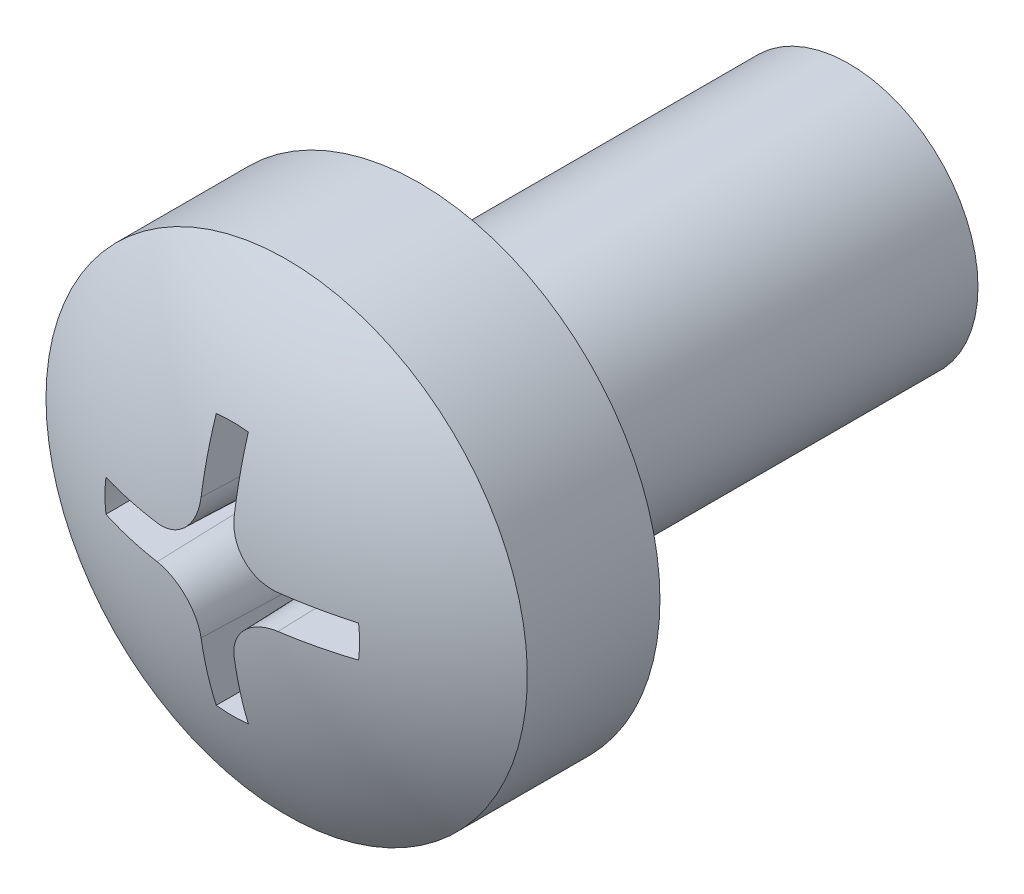
ISO-10303-21;
HEADER;
FILE_DESCRIPTION(('STEP AP214'),'2;1');
FILE_NAME('part.step','',(''),(''),'','','');
FILE_SCHEMA(('AUTOMOTIVE_DESIGN { 1 0 10303 214 1 1 1 1 }'));
ENDSEC;
DATA;
#1=APPLICATION_CONTEXT('core data for automotive mechanical design processes');
#2=APPLICATION_PROTOCOL_DEFINITION('international standard','automotive_design',2000,#1);
#3=PRODUCT_CONTEXT('',#1,'mechanical');
#4=PRODUCT('Part','Part','',(#3));
#5=PRODUCT_RELATED_PRODUCT_CATEGORY('part','',(#4));
#6=PRODUCT_DEFINITION_FORMATION('','',#4);
#7=PRODUCT_DEFINITION_CONTEXT('part definition',#1,'design');
#8=PRODUCT_DEFINITION('design','',#6,#7);
#9=PRODUCT_DEFINITION_SHAPE('','',#8);
#10=(LENGTH_UNIT() NAMED_UNIT(*) SI_UNIT(.MILLI.,.METRE.));
#11=(NAMED_UNIT(*) PLANE_ANGLE_UNIT() SI_UNIT($,.RADIAN.));
#12=(NAMED_UNIT(*) SI_UNIT($,.STERADIAN.) SOLID_ANGLE_UNIT());
#13=UNCERTAINTY_MEASURE_WITH_UNIT(LENGTH_MEASURE(1.E-05),#10,'distance_accuracy_value','');
#14=(GEOMETRIC_REPRESENTATION_CONTEXT(3) GLOBAL_UNCERTAINTY_ASSIGNED_CONTEXT((#13)) GLOBAL_UNIT_ASSIGNED_CONTEXT((#10,
#11,#12)) REPRESENTATION_CONTEXT('',''));
#15=CARTESIAN_POINT('',(0.,0.,0.));
#16=DIRECTION('',(0.,0.,1.));
#17=DIRECTION('',(1.,0.,0.));
#18=AXIS2_PLACEMENT_3D('',#15,#16,#17);
#19=CARTESIAN_POINT('',(0.,0.,5.));
#20=DIRECTION('',(0.,0.,-1.));
#21=DIRECTION('',(-1.,0.,0.));
#22=AXIS2_PLACEMENT_3D('',#19,#20,#21);
#23=CYLINDRICAL_SURFACE('',#22,1.5);
#24=CARTESIAN_POINT('',(0.,0.,5.));
#25=DIRECTION('',(0.,0.,1.));
#26=DIRECTION('',(1.,0.,0.));
#27=AXIS2_PLACEMENT_3D('',#24,#25,#26);
#28=CIRCLE('',#27,1.5);
#29=CARTESIAN_POINT('',(1.5,0.,5.));
#30=VERTEX_POINT('',#29);
#31=EDGE_CURVE('E208',#30,#30,#28,.T.);
#32=ORIENTED_EDGE('',*,*,#31,.F.);
#33=EDGE_LOOP('',(#32));
#34=FACE_BOUND('',#33,.T.);
#35=CARTESIAN_POINT('',(0.,0.,-0.0001));
#36=DIRECTION('',(0.,0.,1.));
#37=DIRECTION('',(1.,0.,0.));
#38=AXIS2_PLACEMENT_3D('',#35,#36,#37);
#39=CIRCLE('',#38,1.5);
#40=CARTESIAN_POINT('',(1.5,0.,-0.0001));
#41=VERTEX_POINT('',#40);
#42=EDGE_CURVE('E205',#41,#41,#39,.T.);
#43=ORIENTED_EDGE('',*,*,#42,.T.);
#44=EDGE_LOOP('',(#43));
#45=FACE_BOUND('',#44,.T.);
#46=ADVANCED_FACE('F34',(#34,#45),#23,.T.);
#47=CARTESIAN_POINT('',(0.,0.,-0.0001));
#48=DIRECTION('',(0.,0.,1.));
#49=DIRECTION('',(1.,0.,0.));
#50=AXIS2_PLACEMENT_3D('',#47,#48,#49);
#51=PLANE('',#50);
#52=ORIENTED_EDGE('',*,*,#42,.F.);
#53=EDGE_LOOP('',(#52));
#54=FACE_BOUND('',#53,.T.);
#55=ADVANCED_FACE('F295',(#54),#51,.F.);
#56=CARTESIAN_POINT('',(0.,0.,5.));
#57=DIRECTION('',(0.,0.,-1.));
#58=DIRECTION('',(-1.,0.,0.));
#59=AXIS2_PLACEMENT_3D('',#56,#57,#58);
#60=PLANE('',#59);
#61=ORIENTED_EDGE('',*,*,#31,.T.);
#62=EDGE_LOOP('',(#61));
#63=FACE_BOUND('',#62,.T.);
#64=CARTESIAN_POINT('',(0.,0.,5.));
#65=DIRECTION('',(0.,0.,-1.));
#66=DIRECTION('',(-1.,0.,0.));
#67=AXIS2_PLACEMENT_3D('',#64,#65,#66);
#68=CIRCLE('',#67,2.79999990016222);
#69=CARTESIAN_POINT('',(-2.79999990016222,0.,5.));
#70=VERTEX_POINT('',#69);
#71=EDGE_CURVE('E202',#70,#70,#68,.T.);
#72=ORIENTED_EDGE('',*,*,#71,.T.);
#73=EDGE_LOOP('',(#72));
#74=FACE_BOUND('',#73,.T.);
#75=ADVANCED_FACE('F300',(#63,#74),#60,.T.);
#76=CARTESIAN_POINT('',(0.,0.,-0.393620134621003));
#77=DIRECTION('',(0.,0.,-1.));
#78=DIRECTION('',(-1.,0.,0.));
#79=AXIS2_PLACEMENT_3D('',#76,#77,#78);
#80=CYLINDRICAL_SURFACE('',#79,2.79999990016222);
#81=CARTESIAN_POINT('',(0.,0.,6.54246307978926));
#82=DIRECTION('',(0.,0.,-1.));
#83=DIRECTION('',(-1.,0.,0.));
#84=AXIS2_PLACEMENT_3D('',#81,#82,#83);
#85=CIRCLE('',#84,2.79999990016222);
#86=CARTESIAN_POINT('',(-2.79999990016222,0.,6.54246307978926));
#87=VERTEX_POINT('',#86);
#88=EDGE_CURVE('E150',#87,#87,#85,.T.);
#89=ORIENTED_EDGE('',*,*,#88,.T.);
#90=EDGE_LOOP('',(#89));
#91=FACE_BOUND('',#90,.T.);
#92=ORIENTED_EDGE('',*,*,#71,.F.);
#93=EDGE_LOOP('',(#92));
#94=FACE_BOUND('',#93,.T.);
#95=ADVANCED_FACE('F308',(#91,#94),#80,.T.);
#96=CARTESIAN_POINT('',(0.,0.,2.40000011175871));
#97=DIRECTION('',(0.,0.,-1.));
#98=DIRECTION('',(1.,0.,0.));
#99=AXIS2_PLACEMENT_3D('',#96,#97,#98);
#100=SPHERICAL_SURFACE('',#99,4.99999988824129);
#101=CARTESIAN_POINT('',(0.,0.,7.17541838215017));
#102=DIRECTION('',(0.,0.,-1.));
#103=DIRECTION('',(-1.,0.,0.));
#104=AXIS2_PLACEMENT_3D('',#101,#102,#103);
#105=CIRCLE('',#104,1.4816812157899);
#106=CARTESIAN_POINT('',(0.18668120666759,1.46987392394782,7.17541838215014));
#107=VERTEX_POINT('',#106);
#108=CARTESIAN_POINT('',(-0.186681206667593,1.46987392394782,7.17541838215014));
#109=VERTEX_POINT('',#108);
#110=EDGE_CURVE('E11',#107,#109,#105,.F.);
#111=ORIENTED_EDGE('',*,*,#110,.F.);
#112=CARTESIAN_POINT('',(0.0198956640512633,0.,2.39930533986049));
#113=DIRECTION('',(0.999390827019096,0.,-0.034899496702501));
#114=DIRECTION('',(-0.034899496702501,0.,-0.999390827019096));
#115=AXIS2_PLACEMENT_3D('',#112,#113,#114);
#116=CIRCLE('',#115,4.99996025606773);
#117=CARTESIAN_POINT('',(0.192632610704328,0.708178557647151,7.34584429553512));
#118=VERTEX_POINT('',#117);
#119=EDGE_CURVE('E41',#107,#118,#116,.T.);
#120=ORIENTED_EDGE('',*,*,#119,.T.);
#121=CARTESIAN_POINT('',(0.192631650862954,0.708378557647151,7.34581569147501));
#122=CARTESIAN_POINT('',(0.192737639690806,0.679822741796073,7.34990414397343));
#123=CARTESIAN_POINT('',(0.195268867839181,0.651227392830895,7.35364633624145));
#124=CARTESIAN_POINT('',(0.205046889209158,0.594767038274589,7.36034605517117));
#125=CARTESIAN_POINT('',(0.212292618678018,0.566901869404939,7.36330375862852));
#126=CARTESIAN_POINT('',(0.231373694375068,0.51267267841366,7.36834660632538));
#127=CARTESIAN_POINT('',(0.24321326807329,0.486310064716558,7.37043094316672));
#128=CARTESIAN_POINT('',(0.271156607880554,0.435900324544808,7.37366034910124));
#129=CARTESIAN_POINT('',(0.287258672100205,0.411852279143785,7.37480579232145));
#130=CARTESIAN_POINT('',(0.323072075489886,0.367028886470805,7.37611580257173));
#131=CARTESIAN_POINT('',(0.342740648168188,0.346219679514825,7.37629128935958));
#132=CARTESIAN_POINT('',(0.385246757538768,0.308146709447779,7.37568534569509));
#133=CARTESIAN_POINT('',(0.408084792807392,0.290883505206881,7.37490376453834));
#134=CARTESIAN_POINT('',(0.456147210008962,0.260464262414973,7.37241339517053));
#135=CARTESIAN_POINT('',(0.481359759209806,0.247289131136678,7.37070902247329));
#136=CARTESIAN_POINT('',(0.533541444049374,0.225283958921734,7.3664258870809));
#137=CARTESIAN_POINT('',(0.560509920861878,0.216452298826715,7.36384745082543));
#138=CARTESIAN_POINT('',(0.606876295057339,0.205379627868596,7.35882076515576));
#139=CARTESIAN_POINT('',(0.626020977094075,0.201943221890058,7.35658129607485));
#140=CARTESIAN_POINT('',(0.664502044043211,0.197253494550335,7.3517582366185));
#141=CARTESIAN_POINT('',(0.683838077649067,0.195996727127303,7.34917519641301));
#142=CARTESIAN_POINT('',(0.703167546290468,0.195835015722445,7.34643346629547));
#143=B_SPLINE_CURVE_WITH_KNOTS('',3,(#121,#122,#123,#124,#125,#126,#127,#128,#129,#130,#131,
#132,#133,#134,#135,#136,#137,#138,#139,#140,#141,#142),.UNSPECIFIED.,.F.,.F.,(4,2,2,2,2,2,2,2,
2,2,4),(0.,0.0864417829586748,0.172864068455127,0.259366073122685,0.345833591994609,
0.43132564691208,0.516831165542017,0.601931114274005,0.686999315371811,0.745618262708562,
0.804144447281415),.UNSPECIFIED.);
#144=CARTESIAN_POINT('',(0.702917362553185,0.19583721033533,7.3464689381926));
#145=VERTEX_POINT('',#144);
#146=EDGE_CURVE('E277',#118,#145,#143,.T.);
#147=ORIENTED_EDGE('',*,*,#146,.T.);
#148=CARTESIAN_POINT('',(0.00010539015335045,0.0259265633149155,2.39909472873738));
#149=DIRECTION('',(0.00406243901494415,0.999382570249833,-0.034899496702501));
#150=DIRECTION('',(0.,0.0348997846864301,0.999390816962434));
#151=AXIS2_PLACEMENT_3D('',#148,#149,#150);
#152=CIRCLE('',#151,4.99993258603575);
#153=CARTESIAN_POINT('',(1.46986565043204,0.186746338396853,7.17541838215017));
#154=VERTEX_POINT('',#153);
#155=EDGE_CURVE('E275',#154,#145,#152,.F.);
#156=ORIENTED_EDGE('',*,*,#155,.F.);
#157=CARTESIAN_POINT('',(0.,0.,7.17541838215017));
#158=DIRECTION('',(0.,0.,-1.));
#159=DIRECTION('',(-1.,0.,0.));
#160=AXIS2_PLACEMENT_3D('',#157,#158,#159);
#161=CIRCLE('',#160,1.4816812157899);
#162=CARTESIAN_POINT('',(1.46986565043204,-0.186746338396852,7.17541838215014));
#163=VERTEX_POINT('',#162);
#164=EDGE_CURVE('E273',#163,#154,#161,.F.);
#165=ORIENTED_EDGE('',*,*,#164,.F.);
#166=CARTESIAN_POINT('',(0.000105390153350481,-0.0259265633149169,2.39909472873738));
#167=DIRECTION('',(0.00406243901494512,-0.999382570249833,-0.034899496702501));
#168=DIRECTION('',(0.,0.0348997846864301,-0.999390816962434));
#169=AXIS2_PLACEMENT_3D('',#166,#167,#168);
#170=CIRCLE('',#169,4.99993258603575);
#171=CARTESIAN_POINT('',(0.702917362553185,-0.195837210335331,7.3464689381926));
#172=VERTEX_POINT('',#171);
#173=EDGE_CURVE('E270',#163,#172,#170,.T.);
#174=ORIENTED_EDGE('',*,*,#173,.T.);
#175=CARTESIAN_POINT('',(0.192631650862954,-0.708378557647152,7.34581569147501));
#176=CARTESIAN_POINT('',(0.192737639690806,-0.679822741796074,7.34990414397343));
#177=CARTESIAN_POINT('',(0.195268867839181,-0.651227392830896,7.35364633624145));
#178=CARTESIAN_POINT('',(0.205046889209158,-0.59476703827459,7.36034605517117));
#179=CARTESIAN_POINT('',(0.212292618678018,-0.566901869404939,7.36330375862852));
#180=CARTESIAN_POINT('',(0.231373694375068,-0.51267267841366,7.36834660632538));
#181=CARTESIAN_POINT('',(0.24321326807329,-0.486310064716559,7.37043094316673));
#182=CARTESIAN_POINT('',(0.271156607880554,-0.435900324544809,7.37366034910124));
#183=CARTESIAN_POINT('',(0.287258672100205,-0.411852279143786,7.37480579232145));
#184=CARTESIAN_POINT('',(0.323072075489886,-0.367028886470806,7.37611580257173));
#185=CARTESIAN_POINT('',(0.342740648168188,-0.346219679514826,7.37629128935958));
#186=CARTESIAN_POINT('',(0.385246757538768,-0.30814670944778,7.37568534569509));
#187=CARTESIAN_POINT('',(0.408084792807393,-0.290883505206882,7.37490376453834));
#188=CARTESIAN_POINT('',(0.456147210008962,-0.260464262414974,7.37241339517053));
#189=CARTESIAN_POINT('',(0.481359759209806,-0.247289131136679,7.37070902247329));
#190=CARTESIAN_POINT('',(0.533541444049375,-0.225283958921735,7.3664258870809));
#191=CARTESIAN_POINT('',(0.560509920861878,-0.216452298826716,7.36384745082543));
#192=CARTESIAN_POINT('',(0.606876295057339,-0.205379627868597,7.35882076515576));
#193=CARTESIAN_POINT('',(0.626020977094075,-0.201943221890059,7.35658129607485));
#194=CARTESIAN_POINT('',(0.664502044043211,-0.197253494550336,7.3517582366185));
#195=CARTESIAN_POINT('',(0.683838077649067,-0.195996727127304,7.34917519641301));
#196=CARTESIAN_POINT('',(0.703167546290467,-0.195835015722445,7.34643346629547));
#197=B_SPLINE_CURVE_WITH_KNOTS('',3,(#175,#176,#177,#178,#179,#180,#181,#182,#183,#184,#185,
#186,#187,#188,#189,#190,#191,#192,#193,#194,#195,#196),.UNSPECIFIED.,.F.,.F.,(4,2,2,2,2,2,2,2,
2,2,4),(0.,0.086441782958675,0.172864068455127,0.259366073122685,0.345833591994609,
0.43132564691208,0.516831165542017,0.601931114274005,0.686999315371811,0.745618262708562,
0.804144447281415),.UNSPECIFIED.);
#198=CARTESIAN_POINT('',(0.192632610704328,-0.708178557647152,7.34584429553512));
#199=VERTEX_POINT('',#198);
#200=EDGE_CURVE('E264',#199,#172,#197,.T.);
#201=ORIENTED_EDGE('',*,*,#200,.F.);
#202=CARTESIAN_POINT('',(0.0198956640512633,0.,2.39930533986049));
#203=DIRECTION('',(0.999390827019096,0.,-0.034899496702501));
#204=DIRECTION('',(-0.034899496702501,0.,-0.999390827019096));
#205=AXIS2_PLACEMENT_3D('',#202,#203,#204);
#206=CIRCLE('',#205,4.99996025606773);
#207=CARTESIAN_POINT('',(0.186681206667591,-1.46987392394782,7.17541838215017));
#208=VERTEX_POINT('',#207);
#209=EDGE_CURVE('E262',#208,#199,#206,.F.);
#210=ORIENTED_EDGE('',*,*,#209,.F.);
#211=CARTESIAN_POINT('',(0.,0.,7.17541838215017));
#212=DIRECTION('',(0.,0.,-1.));
#213=DIRECTION('',(-1.,0.,0.));
#214=AXIS2_PLACEMENT_3D('',#211,#212,#213);
#215=CIRCLE('',#214,1.4816812157899);
#216=CARTESIAN_POINT('',(-0.186681206667593,-1.46987392394782,7.17541838215014));
#217=VERTEX_POINT('',#216);
#218=EDGE_CURVE('E259',#208,#217,#215,.T.);
#219=ORIENTED_EDGE('',*,*,#218,.T.);
#220=CARTESIAN_POINT('',(-0.0198956640512654,0.,2.39930533986049));
#221=DIRECTION('',(-0.999390827019096,0.,-0.034899496702501));
#222=DIRECTION('',(-0.034899496702501,0.,0.999390827019096));
#223=AXIS2_PLACEMENT_3D('',#220,#221,#222);
#224=CIRCLE('',#223,4.99996025606773);
#225=CARTESIAN_POINT('',(-0.19263261070433,-0.708178557647151,7.34584429553512));
#226=VERTEX_POINT('',#225);
#227=EDGE_CURVE('E255',#217,#226,#224,.T.);
#228=ORIENTED_EDGE('',*,*,#227,.T.);
#229=CARTESIAN_POINT('',(-0.703167546290469,-0.195835015722445,7.34643346629547));
#230=CARTESIAN_POINT('',(-0.674619447950853,-0.196052963217916,7.35048572416475));
#231=CARTESIAN_POINT('',(-0.646041434637229,-0.198695168407334,7.35418904161906));
#232=CARTESIAN_POINT('',(-0.589634494727846,-0.208689654905481,7.36080680147558));
#233=CARTESIAN_POINT('',(-0.561805393198952,-0.216040826152063,7.36372142956822));
#234=CARTESIAN_POINT('',(-0.50766612082123,-0.235323893103952,7.36867508610456));
#235=CARTESIAN_POINT('',(-0.481357369172764,-0.247259991703852,7.37071330752301));
#236=CARTESIAN_POINT('',(-0.431071022991569,-0.275383990623327,7.37384890996341));
#237=CARTESIAN_POINT('',(-0.407092510169895,-0.291570206692358,7.37494666294437));
#238=CARTESIAN_POINT('',(-0.362416703115867,-0.327538701485094,7.37616180832018));
#239=CARTESIAN_POINT('',(-0.34168588735275,-0.347278991317759,7.37628996638402));
#240=CARTESIAN_POINT('',(-0.303780328011577,-0.389912448398922,7.37559036471605));
#241=CARTESIAN_POINT('',(-0.286606147147997,-0.412806113607388,7.37476245385545));
#242=CARTESIAN_POINT('',(-0.25636685808405,-0.460969475916929,7.37218162580557));
#243=CARTESIAN_POINT('',(-0.243283863198687,-0.486228184526672,7.37043282748058));
#244=CARTESIAN_POINT('',(-0.22146899790456,-0.538485231439468,7.36606389829698));
#245=CARTESIAN_POINT('',(-0.212735526227358,-0.565482925398505,7.36344408869266));
#246=CARTESIAN_POINT('',(-0.201823996880683,-0.61191361527353,7.35834781298739));
#247=CARTESIAN_POINT('',(-0.198453223120025,-0.631098599357625,7.3560784464194));
#248=CARTESIAN_POINT('',(-0.193901764340931,-0.669652448873598,7.35119687303864));
#249=CARTESIAN_POINT('',(-0.192717622166764,-0.689020975292663,7.34858521441869));
#250=CARTESIAN_POINT('',(-0.192631650862956,-0.708378557647151,7.34581569147501));
#251=B_SPLINE_CURVE_WITH_KNOTS('',3,(#229,#230,#231,#232,#233,#234,#235,#236,#237,#238,#239,
#240,#241,#242,#243,#244,#245,#246,#247,#248,#249,#250),.UNSPECIFIED.,.F.,.F.,(4,2,2,2,2,2,2,2,
2,2,4),(0.,0.0864053436114192,0.172790326060609,0.259254685287909,0.34568483171133,
0.431153892876567,0.51663646625136,0.601739908197796,0.686811996276178,0.745524819849982,
0.804144736260156),.UNSPECIFIED.);
#252=CARTESIAN_POINT('',(-0.702917362553187,-0.195837210335331,7.3464689381926));
#253=VERTEX_POINT('',#252);
#254=EDGE_CURVE('E248',#253,#226,#251,.T.);
#255=ORIENTED_EDGE('',*,*,#254,.F.);
#256=CARTESIAN_POINT('',(-0.000105390153349556,-0.0259265633149168,2.39909472873738));
#257=DIRECTION('',(-0.0040624390149453,-0.999382570249833,-0.034899496702501));
#258=DIRECTION('',(0.,0.0348997846864301,-0.999390816962434));
#259=AXIS2_PLACEMENT_3D('',#256,#257,#258);
#260=CIRCLE('',#259,4.99993258603575);
#261=CARTESIAN_POINT('',(-1.46986565043204,-0.186746338396853,7.17541838215018));
#262=VERTEX_POINT('',#261);
#263=EDGE_CURVE('E256',#262,#253,#260,.F.);
#264=ORIENTED_EDGE('',*,*,#263,.F.);
#265=CARTESIAN_POINT('',(0.,0.,7.17541838215018));
#266=DIRECTION('',(0.,0.,-1.));
#267=DIRECTION('',(-1.,0.,0.));
#268=AXIS2_PLACEMENT_3D('',#265,#266,#267);
#269=CIRCLE('',#268,1.4816812157899);
#270=CARTESIAN_POINT('',(-1.46986565043204,0.186746338396852,7.17541838215014));
#271=VERTEX_POINT('',#270);
#272=EDGE_CURVE('E594',#262,#271,#269,.T.);
#273=ORIENTED_EDGE('',*,*,#272,.T.);
#274=CARTESIAN_POINT('',(-0.000105390153349556,0.0259265633149168,2.39909472873738));
#275=DIRECTION('',(-0.00406243901494529,0.999382570249833,-0.034899496702501));
#276=DIRECTION('',(0.,0.0348997846864301,0.999390816962434));
#277=AXIS2_PLACEMENT_3D('',#274,#275,#276);
#278=CIRCLE('',#277,4.99993258603575);
#279=CARTESIAN_POINT('',(-0.702917362553187,0.195837210335331,7.3464689381926));
#280=VERTEX_POINT('',#279);
#281=EDGE_CURVE('E221',#271,#280,#278,.T.);
#282=ORIENTED_EDGE('',*,*,#281,.T.);
#283=CARTESIAN_POINT('',(-0.192631650862955,0.708378557647151,7.34581569147501));
#284=CARTESIAN_POINT('',(-0.192737639690808,0.679822741796074,7.34990414397343));
#285=CARTESIAN_POINT('',(-0.195268867839183,0.651227392830896,7.35364633624145));
#286=CARTESIAN_POINT('',(-0.20504688920916,0.59476703827459,7.36034605517117));
#287=CARTESIAN_POINT('',(-0.21229261867802,0.566901869404939,7.36330375862852));
#288=CARTESIAN_POINT('',(-0.23137369437507,0.51267267841366,7.36834660632538));
#289=CARTESIAN_POINT('',(-0.243213268073292,0.486310064716558,7.37043094316673));
#290=CARTESIAN_POINT('',(-0.271156607880556,0.435900324544809,7.37366034910124));
#291=CARTESIAN_POINT('',(-0.287258672100207,0.411852279143786,7.37480579232145));
#292=CARTESIAN_POINT('',(-0.323072075489888,0.367028886470806,7.37611580257173));
#293=CARTESIAN_POINT('',(-0.34274064816819,0.346219679514825,7.37629128935958));
#294=CARTESIAN_POINT('',(-0.38524675753877,0.30814670944778,7.37568534569509));
#295=CARTESIAN_POINT('',(-0.408084792807394,0.290883505206881,7.37490376453834));
#296=CARTESIAN_POINT('',(-0.456147210008964,0.260464262414973,7.37241339517053));
#297=CARTESIAN_POINT('',(-0.481359759209807,0.247289131136679,7.37070902247329));
#298=CARTESIAN_POINT('',(-0.533541444049376,0.225283958921734,7.3664258870809));
#299=CARTESIAN_POINT('',(-0.56050992086188,0.216452298826716,7.36384745082543));
#300=CARTESIAN_POINT('',(-0.606876295057341,0.205379627868597,7.35882076515576));
#301=CARTESIAN_POINT('',(-0.626020977094076,0.201943221890059,7.35658129607485));
#302=CARTESIAN_POINT('',(-0.664502044043212,0.197253494550336,7.3517582366185));
#303=CARTESIAN_POINT('',(-0.683838077649069,0.195996727127304,7.34917519641301));
#304=CARTESIAN_POINT('',(-0.703167546290469,0.195835015722445,7.34643346629547));
#305=B_SPLINE_CURVE_WITH_KNOTS('',3,(#283,#284,#285,#286,#287,#288,#289,#290,#291,#292,#293,
#294,#295,#296,#297,#298,#299,#300,#301,#302,#303,#304),.UNSPECIFIED.,.F.,.F.,(4,2,2,2,2,2,2,2,
2,2,4),(0.,0.0864417829586746,0.172864068455127,0.259366073122685,0.345833591994609,
0.431325646912079,0.516831165542017,0.601931114274005,0.686999315371811,0.745618262708562,
0.804144447281414),.UNSPECIFIED.);
#306=CARTESIAN_POINT('',(-0.19263261070433,0.708178557647151,7.34584429553512));
#307=VERTEX_POINT('',#306);
#308=EDGE_CURVE('E213',#307,#280,#305,.T.);
#309=ORIENTED_EDGE('',*,*,#308,.F.);
#310=CARTESIAN_POINT('',(-0.0198956640512644,0.,2.39930533986049));
#311=DIRECTION('',(-0.999390827019096,0.,-0.034899496702501));
#312=DIRECTION('',(-0.034899496702501,0.,0.999390827019096));
#313=AXIS2_PLACEMENT_3D('',#310,#311,#312);
#314=CIRCLE('',#313,4.99996025606773);
#315=EDGE_CURVE('E211',#109,#307,#314,.F.);
#316=ORIENTED_EDGE('',*,*,#315,.F.);
#317=EDGE_LOOP('',(#111,#120,#147,#156,#165,#174,#201,#210,#219,#228,#255,#264,#273,#282,#309,#316));
#318=FACE_BOUND('',#317,.T.);
#319=ORIENTED_EDGE('',*,*,#88,.F.);
#320=EDGE_LOOP('',(#319));
#321=FACE_BOUND('',#320,.T.);
#322=ADVANCED_FACE('F223',(#318,#321),#100,.T.);
#323=CARTESIAN_POINT('',(0.,0.,7.7000001));
#324=DIRECTION('',(0.,0.,1.));
#325=DIRECTION('',(1.,0.,0.));
#326=AXIS2_PLACEMENT_3D('',#323,#324,#325);
#327=CONICAL_SURFACE('',#326,1.50000001303852,0.0349065850398867);
#328=ORIENTED_EDGE('',*,*,#110,.T.);
#329=CARTESIAN_POINT('',(-0.142142619910814,1.43009594495933,5.90000013091991));
#330=CARTESIAN_POINT('',(-0.152618658076336,1.43957885994155,6.19999461322929));
#331=CARTESIAN_POINT('',(-0.163094792502732,1.4489727928664,6.49999185208944));
#332=CARTESIAN_POINT('',(-0.184047253837866,1.46758269456637,7.09999184178283));
#333=CARTESIAN_POINT('',(-0.194523580746602,1.47679866334215,7.39999459261603));
#334=CARTESIAN_POINT('',(-0.205000003916213,1.48592565006124,7.7000001));
#335=B_SPLINE_CURVE_WITH_KNOTS('',3,(#329,#330,#331,#332,#333,#334),.UNSPECIFIED.,.F.,.F.,(4,2,
4),(0.,0.900981158642232,1.80196231389533),.UNSPECIFIED.);
#336=CARTESIAN_POINT('',(-0.142142619910814,1.43009594495933,5.90000013091991));
#337=VERTEX_POINT('',#336);
#338=EDGE_CURVE('E48',#337,#109,#335,.T.);
#339=ORIENTED_EDGE('',*,*,#338,.F.);
#340=CARTESIAN_POINT('',(0.,0.,5.90000013091991));
#341=DIRECTION('',(0.,0.,1.));
#342=DIRECTION('',(1.,0.,0.));
#343=AXIS2_PLACEMENT_3D('',#340,#341,#342);
#344=CIRCLE('',#343,1.43714262903312);
#345=CARTESIAN_POINT('',(0.142142619910811,1.43009594495933,5.90000013091991));
#346=VERTEX_POINT('',#345);
#347=EDGE_CURVE('E158',#346,#337,#344,.T.);
#348=ORIENTED_EDGE('',*,*,#347,.F.);
#349=CARTESIAN_POINT('',(0.142142619910811,1.43009594495933,5.90000013091991));
#350=CARTESIAN_POINT('',(0.152618658076333,1.43957885994155,6.19999461322929));
#351=CARTESIAN_POINT('',(0.16309479250273,1.4489727928664,6.49999185208944));
#352=CARTESIAN_POINT('',(0.184047253837863,1.46758269456637,7.09999184178283));
#353=CARTESIAN_POINT('',(0.1945235807466,1.47679866334215,7.39999459261603));
#354=CARTESIAN_POINT('',(0.205000003916211,1.48592565006124,7.7000001));
#355=B_SPLINE_CURVE_WITH_KNOTS('',3,(#349,#350,#351,#352,#353,#354),.UNSPECIFIED.,.F.,.F.,(4,2,
4),(0.,0.900981158642232,1.80196231389533),.UNSPECIFIED.);
#356=EDGE_CURVE('E142',#346,#107,#355,.T.);
#357=ORIENTED_EDGE('',*,*,#356,.T.);
#358=EDGE_LOOP('',(#328,#339,#348,#357));
#359=FACE_BOUND('',#358,.T.);
#360=ADVANCED_FACE('F162',(#359),#327,.F.);
#361=CARTESIAN_POINT('',(0.205000003916211,1.48592565006124,7.7000001));
#362=DIRECTION('',(0.999390827019096,0.,-0.034899496702501));
#363=DIRECTION('',(-0.034899496702501,0.,-0.999390827019096));
#364=AXIS2_PLACEMENT_3D('',#361,#362,#363);
#365=PLANE('',#364);
#366=ORIENTED_EDGE('',*,*,#356,.F.);
#367=DIRECTION('',(0.,1.,0.));
#368=VECTOR('',#367,1.);
#369=CARTESIAN_POINT('',(0.142142619910812,0.,5.90000013091991));
#370=LINE('',#369,#368);
#371=CARTESIAN_POINT('',(0.142142619910811,0.708178557647151,5.90000013091991));
#372=VERTEX_POINT('',#371);
#373=EDGE_CURVE('E145',#346,#372,#370,.F.);
#374=ORIENTED_EDGE('',*,*,#373,.T.);
#375=DIRECTION('',(0.034899496702501,0.,0.999390827019096));
#376=VECTOR('',#375,1.);
#377=CARTESIAN_POINT('',(0.20500000391621,0.708178557647151,7.7000001));
#378=LINE('',#377,#376);
#379=EDGE_CURVE('E151',#372,#118,#378,.T.);
#380=ORIENTED_EDGE('',*,*,#379,.T.);
#381=ORIENTED_EDGE('',*,*,#119,.F.);
#382=EDGE_LOOP('',(#366,#374,#380,#381));
#383=FACE_BOUND('',#382,.T.);
#384=ADVANCED_FACE('F144',(#383),#365,.F.);
#385=CARTESIAN_POINT('',(0.705000003916211,0.708178557647151,7.7000001));
#386=DIRECTION('',(0.,0.,-1.));
#387=DIRECTION('',(1.,0.,0.));
#388=AXIS2_PLACEMENT_3D('',#385,#386,#387);
#389=CONICAL_SURFACE('',#388,0.5,0.0349065850398867);
#390=ORIENTED_EDGE('',*,*,#379,.F.);
#391=CARTESIAN_POINT('',(0.705000003916211,0.708178557647151,5.90000013091991));
#392=DIRECTION('',(0.,0.,1.));
#393=DIRECTION('',(1.,0.,0.));
#394=AXIS2_PLACEMENT_3D('',#391,#392,#393);
#395=CIRCLE('',#394,0.562857384005399);
#396=CARTESIAN_POINT('',(0.702712036351556,0.145325823858085,5.90000013091991));
#397=VERTEX_POINT('',#396);
#398=EDGE_CURVE('E160',#372,#397,#395,.T.);
#399=ORIENTED_EDGE('',*,*,#398,.T.);
#400=DIRECTION('',(0.000141863496415148,0.0348992083697649,0.999390827019096));
#401=VECTOR('',#400,1.);
#402=CARTESIAN_POINT('',(0.702967546290468,0.208182688548215,7.7000001));
#403=LINE('',#402,#401);
#404=EDGE_CURVE('E418',#397,#145,#403,.T.);
#405=ORIENTED_EDGE('',*,*,#404,.T.);
#406=ORIENTED_EDGE('',*,*,#146,.F.);
#407=EDGE_LOOP('',(#390,#399,#405,#406));
#408=FACE_BOUND('',#407,.T.);
#409=ADVANCED_FACE('F283',(#408),#389,.T.);
#410=CARTESIAN_POINT('',(1.48592565006123,0.205000003916213,7.7000001));
#411=DIRECTION('',(0.00406243901494415,0.999382570249833,-0.034899496702501));
#412=DIRECTION('',(0.,0.0348997846864301,0.999390816962434));
#413=AXIS2_PLACEMENT_3D('',#410,#411,#412);
#414=PLANE('',#413);
#415=ORIENTED_EDGE('',*,*,#155,.T.);
#416=ORIENTED_EDGE('',*,*,#404,.F.);
#417=DIRECTION('',(-0.99999173819787,0.00406491525148502,0.));
#418=VECTOR('',#417,1.);
#419=CARTESIAN_POINT('',(0.000602343564913371,0.148179863836023,5.90000013091991));
#420=LINE('',#419,#418);
#421=CARTESIAN_POINT('',(1.43007341244828,0.142369137079488,5.90000013091991));
#422=VERTEX_POINT('',#421);
#423=EDGE_CURVE('E171',#422,#397,#420,.T.);
#424=ORIENTED_EDGE('',*,*,#423,.F.);
#425=CARTESIAN_POINT('',(1.43007341244828,0.142369137079488,5.90000013091991));
#426=CARTESIAN_POINT('',(1.43955869120937,0.152806706922151,6.19999467904414));
#427=CARTESIAN_POINT('',(1.44895568373278,0.163244730756208,6.49999195080733));
#428=CARTESIAN_POINT('',(1.46757309626977,0.184121686368453,7.09999194050071));
#429=CARTESIAN_POINT('',(1.47679351628402,0.194560618146638,7.39999465843089));
#430=CARTESIAN_POINT('',(1.48592565006123,0.205000003916213,7.7000001));
#431=B_SPLINE_CURVE_WITH_KNOTS('',3,(#425,#426,#427,#428,#429,#430),.UNSPECIFIED.,.F.,.F.,(4,2,
4),(0.,0.900977563471275,1.80195512360615),.UNSPECIFIED.);
#432=EDGE_CURVE('E412',#422,#154,#431,.T.);
#433=ORIENTED_EDGE('',*,*,#432,.T.);
#434=EDGE_LOOP('',(#415,#416,#424,#433));
#435=FACE_BOUND('',#434,.T.);
#436=ADVANCED_FACE('F235',(#435),#414,.F.);
#437=CARTESIAN_POINT('',(0.,0.,7.7000001));
#438=DIRECTION('',(0.,0.,1.));
#439=DIRECTION('',(1.,0.,0.));
#440=AXIS2_PLACEMENT_3D('',#437,#438,#439);
#441=CONICAL_SURFACE('',#440,1.50000001303852,0.0349065850398867);
#442=ORIENTED_EDGE('',*,*,#164,.T.);
#443=ORIENTED_EDGE('',*,*,#432,.F.);
#444=CARTESIAN_POINT('',(0.,0.,5.90000013091991));
#445=DIRECTION('',(0.,0.,1.));
#446=DIRECTION('',(1.,0.,0.));
#447=AXIS2_PLACEMENT_3D('',#444,#445,#446);
#448=CIRCLE('',#447,1.43714262903312);
#449=CARTESIAN_POINT('',(1.43007341244828,-0.142369137079488,5.90000013091991));
#450=VERTEX_POINT('',#449);
#451=EDGE_CURVE('E173',#450,#422,#448,.T.);
#452=ORIENTED_EDGE('',*,*,#451,.F.);
#453=CARTESIAN_POINT('',(1.43007341244828,-0.142369137079488,5.90000013091991));
#454=CARTESIAN_POINT('',(1.43955869120937,-0.152806706922151,6.19999467904414));
#455=CARTESIAN_POINT('',(1.44895568373278,-0.163244730756208,6.49999195080733));
#456=CARTESIAN_POINT('',(1.46757309626977,-0.184121686368453,7.09999194050071));
#457=CARTESIAN_POINT('',(1.47679351628402,-0.194560618146638,7.39999465843089));
#458=CARTESIAN_POINT('',(1.48592565006123,-0.205000003916213,7.7000001));
#459=B_SPLINE_CURVE_WITH_KNOTS('',3,(#453,#454,#455,#456,#457,#458),.UNSPECIFIED.,.F.,.F.,(4,2,
4),(0.,0.900977563471275,1.80195512360615),.UNSPECIFIED.);
#460=EDGE_CURVE('E406',#450,#163,#459,.T.);
#461=ORIENTED_EDGE('',*,*,#460,.T.);
#462=EDGE_LOOP('',(#442,#443,#452,#461));
#463=FACE_BOUND('',#462,.T.);
#464=ADVANCED_FACE('F291',(#463),#441,.F.);
#465=CARTESIAN_POINT('',(1.48592565006123,-0.205000003916213,7.7000001));
#466=DIRECTION('',(0.00406243901494512,-0.999382570249833,-0.034899496702501));
#467=DIRECTION('',(0.,0.0348997846864301,-0.999390816962434));
#468=AXIS2_PLACEMENT_3D('',#465,#466,#467);
#469=PLANE('',#468);
#470=ORIENTED_EDGE('',*,*,#460,.F.);
#471=DIRECTION('',(0.99999173819787,0.00406491525148599,0.));
#472=VECTOR('',#471,1.);
#473=CARTESIAN_POINT('',(0.00060234356491352,-0.148179863836024,5.90000013091991));
#474=LINE('',#473,#472);
#475=CARTESIAN_POINT('',(0.702712036351556,-0.145325823858086,5.90000013091991));
#476=VERTEX_POINT('',#475);
#477=EDGE_CURVE('E176',#450,#476,#474,.F.);
#478=ORIENTED_EDGE('',*,*,#477,.T.);
#479=DIRECTION('',(0.000141863496415188,-0.0348992083697649,0.999390827019096));
#480=VECTOR('',#479,1.);
#481=CARTESIAN_POINT('',(0.702967546290468,-0.208182688548216,7.7000001));
#482=LINE('',#481,#480);
#483=EDGE_CURVE('E428',#476,#172,#482,.T.);
#484=ORIENTED_EDGE('',*,*,#483,.T.);
#485=ORIENTED_EDGE('',*,*,#173,.F.);
#486=EDGE_LOOP('',(#470,#478,#484,#485));
#487=FACE_BOUND('',#486,.T.);
#488=ADVANCED_FACE('F401',(#487),#469,.F.);
#489=CARTESIAN_POINT('',(0.705000003916211,-0.708178557647152,7.7000001));
#490=DIRECTION('',(0.,0.,-1.));
#491=DIRECTION('',(-1.,0.,0.));
#492=AXIS2_PLACEMENT_3D('',#489,#490,#491);
#493=CONICAL_SURFACE('',#492,0.5,0.0349065850398867);
#494=ORIENTED_EDGE('',*,*,#200,.T.);
#495=ORIENTED_EDGE('',*,*,#483,.F.);
#496=CARTESIAN_POINT('',(0.705000003916211,-0.708178557647152,5.90000013091991));
#497=DIRECTION('',(0.,0.,1.));
#498=DIRECTION('',(1.,0.,0.));
#499=AXIS2_PLACEMENT_3D('',#496,#497,#498);
#500=CIRCLE('',#499,0.562857384005399);
#501=CARTESIAN_POINT('',(0.142142619910812,-0.708178557647152,5.90000013091991));
#502=VERTEX_POINT('',#501);
#503=EDGE_CURVE('E178',#502,#476,#500,.F.);
#504=ORIENTED_EDGE('',*,*,#503,.F.);
#505=DIRECTION('',(0.034899496702501,0.,0.999390827019096));
#506=VECTOR('',#505,1.);
#507=CARTESIAN_POINT('',(0.205000003916211,-0.708178557647152,7.7000001));
#508=LINE('',#507,#506);
#509=EDGE_CURVE('E392',#502,#199,#508,.T.);
#510=ORIENTED_EDGE('',*,*,#509,.T.);
#511=EDGE_LOOP('',(#494,#495,#504,#510));
#512=FACE_BOUND('',#511,.T.);
#513=ADVANCED_FACE('F245',(#512),#493,.T.);
#514=CARTESIAN_POINT('',(0.205000003916211,-1.48592565006124,7.7000001));
#515=DIRECTION('',(0.999390827019096,0.,-0.034899496702501));
#516=DIRECTION('',(-0.034899496702501,0.,-0.999390827019096));
#517=AXIS2_PLACEMENT_3D('',#514,#515,#516);
#518=PLANE('',#517);
#519=ORIENTED_EDGE('',*,*,#209,.T.);
#520=ORIENTED_EDGE('',*,*,#509,.F.);
#521=DIRECTION('',(0.,1.,0.));
#522=VECTOR('',#521,1.);
#523=CARTESIAN_POINT('',(0.142142619910812,0.,5.90000013091991));
#524=LINE('',#523,#522);
#525=CARTESIAN_POINT('',(0.142142619910811,-1.43009594495933,5.90000013091991));
#526=VERTEX_POINT('',#525);
#527=EDGE_CURVE('E181',#526,#502,#524,.T.);
#528=ORIENTED_EDGE('',*,*,#527,.F.);
#529=CARTESIAN_POINT('',(0.142142619910811,-1.43009594495933,5.90000013091991));
#530=CARTESIAN_POINT('',(0.152618658076333,-1.43957885994155,6.19999461322929));
#531=CARTESIAN_POINT('',(0.16309479250273,-1.4489727928664,6.49999185208944));
#532=CARTESIAN_POINT('',(0.184047253837863,-1.46758269456637,7.09999184178283));
#533=CARTESIAN_POINT('',(0.1945235807466,-1.47679866334215,7.39999459261603));
#534=CARTESIAN_POINT('',(0.205000003916211,-1.48592565006124,7.7000001));
#535=B_SPLINE_CURVE_WITH_KNOTS('',3,(#529,#530,#531,#532,#533,#534),.UNSPECIFIED.,.F.,.F.,(4,2,
4),(0.,0.900981158642232,1.80196231389533),.UNSPECIFIED.);
#536=EDGE_CURVE('E384',#526,#208,#535,.T.);
#537=ORIENTED_EDGE('',*,*,#536,.T.);
#538=EDGE_LOOP('',(#519,#520,#528,#537));
#539=FACE_BOUND('',#538,.T.);
#540=ADVANCED_FACE('F394',(#539),#518,.F.);
#541=CARTESIAN_POINT('',(0.,0.,7.7000001));
#542=DIRECTION('',(0.,0.,1.));
#543=DIRECTION('',(-1.,0.,0.));
#544=AXIS2_PLACEMENT_3D('',#541,#542,#543);
#545=CONICAL_SURFACE('',#544,1.50000001303852,0.0349065850398867);
#546=ORIENTED_EDGE('',*,*,#536,.F.);
#547=CARTESIAN_POINT('',(0.,0.,5.90000013091991));
#548=DIRECTION('',(0.,0.,1.));
#549=DIRECTION('',(1.,0.,0.));
#550=AXIS2_PLACEMENT_3D('',#547,#548,#549);
#551=CIRCLE('',#550,1.43714262903312);
#552=CARTESIAN_POINT('',(-0.142142619910814,-1.43009594495933,5.90000013091991));
#553=VERTEX_POINT('',#552);
#554=EDGE_CURVE('E184',#526,#553,#551,.F.);
#555=ORIENTED_EDGE('',*,*,#554,.T.);
#556=CARTESIAN_POINT('',(-0.142142619910814,-1.43009594495933,5.90000013091991));
#557=CARTESIAN_POINT('',(-0.152618658076336,-1.43957885994155,6.19999461322929));
#558=CARTESIAN_POINT('',(-0.163094792502732,-1.4489727928664,6.49999185208944));
#559=CARTESIAN_POINT('',(-0.184047253837866,-1.46758269456637,7.09999184178283));
#560=CARTESIAN_POINT('',(-0.194523580746602,-1.47679866334215,7.39999459261603));
#561=CARTESIAN_POINT('',(-0.205000003916213,-1.48592565006124,7.7000001));
#562=B_SPLINE_CURVE_WITH_KNOTS('',3,(#556,#557,#558,#559,#560,#561),.UNSPECIFIED.,.F.,.F.,(4,2,
4),(0.,0.900981158642232,1.80196231389533),.UNSPECIFIED.);
#563=EDGE_CURVE('E376',#553,#217,#562,.T.);
#564=ORIENTED_EDGE('',*,*,#563,.T.);
#565=ORIENTED_EDGE('',*,*,#218,.F.);
#566=EDGE_LOOP('',(#546,#555,#564,#565));
#567=FACE_BOUND('',#566,.T.);
#568=ADVANCED_FACE('F371',(#567),#545,.F.);
#569=CARTESIAN_POINT('',(-0.205000003916213,-1.48592565006124,7.7000001));
#570=DIRECTION('',(-0.999390827019096,0.,-0.034899496702501));
#571=DIRECTION('',(-0.034899496702501,0.,0.999390827019096));
#572=AXIS2_PLACEMENT_3D('',#569,#570,#571);
#573=PLANE('',#572);
#574=ORIENTED_EDGE('',*,*,#563,.F.);
#575=DIRECTION('',(0.,-1.,0.));
#576=VECTOR('',#575,1.);
#577=CARTESIAN_POINT('',(-0.142142619910814,0.,5.90000013091991));
#578=LINE('',#577,#576);
#579=CARTESIAN_POINT('',(-0.142142619910814,-0.708178557647151,5.90000013091991));
#580=VERTEX_POINT('',#579);
#581=EDGE_CURVE('E186',#553,#580,#578,.F.);
#582=ORIENTED_EDGE('',*,*,#581,.T.);
#583=DIRECTION('',(-0.034899496702501,0.,0.999390827019096));
#584=VECTOR('',#583,1.);
#585=CARTESIAN_POINT('',(-0.205000003916213,-0.708178557647151,7.7000001));
#586=LINE('',#585,#584);
#587=EDGE_CURVE('E385',#580,#226,#586,.T.);
#588=ORIENTED_EDGE('',*,*,#587,.T.);
#589=ORIENTED_EDGE('',*,*,#227,.F.);
#590=EDGE_LOOP('',(#574,#582,#588,#589));
#591=FACE_BOUND('',#590,.T.);
#592=ADVANCED_FACE('F243',(#591),#573,.F.);
#593=CARTESIAN_POINT('',(-0.705000003916213,-0.708178557647151,7.7000001));
#594=DIRECTION('',(0.,0.,-1.));
#595=DIRECTION('',(-1.,0.,0.));
#596=AXIS2_PLACEMENT_3D('',#593,#594,#595);
#597=CONICAL_SURFACE('',#596,0.5,0.0349065850398867);
#598=ORIENTED_EDGE('',*,*,#254,.T.);
#599=ORIENTED_EDGE('',*,*,#587,.F.);
#600=CARTESIAN_POINT('',(-0.705000003916213,-0.708178557647151,5.90000013091991));
#601=DIRECTION('',(0.,0.,1.));
#602=DIRECTION('',(1.,0.,0.));
#603=AXIS2_PLACEMENT_3D('',#600,#601,#602);
#604=CIRCLE('',#603,0.562857384005399);
#605=CARTESIAN_POINT('',(-0.702712036351558,-0.145325823858086,5.90000013091991));
#606=VERTEX_POINT('',#605);
#607=EDGE_CURVE('E188',#606,#580,#604,.F.);
#608=ORIENTED_EDGE('',*,*,#607,.F.);
#609=DIRECTION('',(-0.000141863496415188,-0.0348992083697649,0.999390827019096));
#610=VECTOR('',#609,1.);
#611=CARTESIAN_POINT('',(-0.70296754629047,-0.208182688548216,7.7000001));
#612=LINE('',#611,#610);
#613=EDGE_CURVE('E586',#606,#253,#612,.T.);
#614=ORIENTED_EDGE('',*,*,#613,.T.);
#615=EDGE_LOOP('',(#598,#599,#608,#614));
#616=FACE_BOUND('',#615,.T.);
#617=ADVANCED_FACE('F238',(#616),#597,.T.);
#618=CARTESIAN_POINT('',(-1.48592565006124,-0.205000003916213,7.7000001));
#619=DIRECTION('',(-0.0040624390149453,-0.999382570249833,-0.034899496702501));
#620=DIRECTION('',(0.,0.0348997846864301,-0.999390816962434));
#621=AXIS2_PLACEMENT_3D('',#618,#619,#620);
#622=PLANE('',#621);
#623=ORIENTED_EDGE('',*,*,#263,.T.);
#624=ORIENTED_EDGE('',*,*,#613,.F.);
#625=DIRECTION('',(0.99999173819787,-0.00406491525148617,0.));
#626=VECTOR('',#625,1.);
#627=CARTESIAN_POINT('',(-0.000602343564913546,-0.148179863836024,5.90000013091991));
#628=LINE('',#627,#626);
#629=CARTESIAN_POINT('',(-1.43007341244828,-0.142369137079487,5.90000013091991));
#630=VERTEX_POINT('',#629);
#631=EDGE_CURVE('E191',#630,#606,#628,.T.);
#632=ORIENTED_EDGE('',*,*,#631,.F.);
#633=CARTESIAN_POINT('',(-1.43007341244828,-0.142369137079487,5.90000013091991));
#634=CARTESIAN_POINT('',(-1.43955869120937,-0.152806706922151,6.19999467904414));
#635=CARTESIAN_POINT('',(-1.44895568373278,-0.163244730756207,6.49999195080733));
#636=CARTESIAN_POINT('',(-1.46757309626978,-0.184121686368453,7.09999194050071));
#637=CARTESIAN_POINT('',(-1.47679351628402,-0.194560618146638,7.39999465843089));
#638=CARTESIAN_POINT('',(-1.48592565006124,-0.205000003916213,7.7000001));
#639=B_SPLINE_CURVE_WITH_KNOTS('',3,(#633,#634,#635,#636,#637,#638),.UNSPECIFIED.,.F.,.F.,(4,2,
4),(0.,0.900977563471275,1.80195512360615),.UNSPECIFIED.);
#640=EDGE_CURVE('E351',#630,#262,#639,.T.);
#641=ORIENTED_EDGE('',*,*,#640,.T.);
#642=EDGE_LOOP('',(#623,#624,#632,#641));
#643=FACE_BOUND('',#642,.T.);
#644=ADVANCED_FACE('F242',(#643),#622,.F.);
#645=CARTESIAN_POINT('',(0.,0.,7.7000001));
#646=DIRECTION('',(0.,0.,1.));
#647=DIRECTION('',(-1.,0.,0.));
#648=AXIS2_PLACEMENT_3D('',#645,#646,#647);
#649=CONICAL_SURFACE('',#648,1.50000001303852,0.0349065850398867);
#650=ORIENTED_EDGE('',*,*,#640,.F.);
#651=CARTESIAN_POINT('',(0.,0.,5.90000013091991));
#652=DIRECTION('',(0.,0.,1.));
#653=DIRECTION('',(1.,0.,0.));
#654=AXIS2_PLACEMENT_3D('',#651,#652,#653);
#655=CIRCLE('',#654,1.43714262903312);
#656=CARTESIAN_POINT('',(-1.43007341244828,0.142369137079487,5.90000013091991));
#657=VERTEX_POINT('',#656);
#658=EDGE_CURVE('E194',#630,#657,#655,.F.);
#659=ORIENTED_EDGE('',*,*,#658,.T.);
#660=CARTESIAN_POINT('',(-1.43007341244828,0.142369137079487,5.90000013091991));
#661=CARTESIAN_POINT('',(-1.43955869120937,0.152806706922151,6.19999467904414));
#662=CARTESIAN_POINT('',(-1.44895568373278,0.163244730756207,6.49999195080733));
#663=CARTESIAN_POINT('',(-1.46757309626978,0.184121686368453,7.09999194050071));
#664=CARTESIAN_POINT('',(-1.47679351628402,0.194560618146638,7.39999465843089));
#665=CARTESIAN_POINT('',(-1.48592565006124,0.205000003916213,7.7000001));
#666=B_SPLINE_CURVE_WITH_KNOTS('',3,(#660,#661,#662,#663,#664,#665),.UNSPECIFIED.,.F.,.F.,(4,2,
4),(0.,0.900977563471275,1.80195512360615),.UNSPECIFIED.);
#667=EDGE_CURVE('E334',#657,#271,#666,.T.);
#668=ORIENTED_EDGE('',*,*,#667,.T.);
#669=ORIENTED_EDGE('',*,*,#272,.F.);
#670=EDGE_LOOP('',(#650,#659,#668,#669));
#671=FACE_BOUND('',#670,.T.);
#672=ADVANCED_FACE('F359',(#671),#649,.F.);
#673=CARTESIAN_POINT('',(-1.48592565006124,0.205000003916213,7.7000001));
#674=DIRECTION('',(-0.00406243901494529,0.999382570249833,-0.034899496702501));
#675=DIRECTION('',(0.,0.0348997846864301,0.999390816962434));
#676=AXIS2_PLACEMENT_3D('',#673,#674,#675);
#677=PLANE('',#676);
#678=ORIENTED_EDGE('',*,*,#667,.F.);
#679=DIRECTION('',(-0.99999173819787,-0.00406491525148616,0.));
#680=VECTOR('',#679,1.);
#681=CARTESIAN_POINT('',(-0.000602343564913545,0.148179863836024,5.90000013091991));
#682=LINE('',#681,#680);
#683=CARTESIAN_POINT('',(-0.702712036351557,0.145325823858086,5.90000013091991));
#684=VERTEX_POINT('',#683);
#685=EDGE_CURVE('E196',#657,#684,#682,.F.);
#686=ORIENTED_EDGE('',*,*,#685,.T.);
#687=DIRECTION('',(-0.000141863496415188,0.0348992083697649,0.999390827019096));
#688=VECTOR('',#687,1.);
#689=CARTESIAN_POINT('',(-0.702967546290469,0.208182688548216,7.7000001));
#690=LINE('',#689,#688);
#691=EDGE_CURVE('E332',#684,#280,#690,.T.);
#692=ORIENTED_EDGE('',*,*,#691,.T.);
#693=ORIENTED_EDGE('',*,*,#281,.F.);
#694=EDGE_LOOP('',(#678,#686,#692,#693));
#695=FACE_BOUND('',#694,.T.);
#696=ADVANCED_FACE('F233',(#695),#677,.F.);
#697=CARTESIAN_POINT('',(-0.705000003916212,0.708178557647151,7.7000001));
#698=DIRECTION('',(0.,0.,-1.));
#699=DIRECTION('',(-1.,0.,0.));
#700=AXIS2_PLACEMENT_3D('',#697,#698,#699);
#701=CONICAL_SURFACE('',#700,0.5,0.0349065850398867);
#702=ORIENTED_EDGE('',*,*,#308,.T.);
#703=ORIENTED_EDGE('',*,*,#691,.F.);
#704=CARTESIAN_POINT('',(-0.705000003916212,0.708178557647151,5.90000013091991));
#705=DIRECTION('',(0.,0.,1.));
#706=DIRECTION('',(1.,0.,0.));
#707=AXIS2_PLACEMENT_3D('',#704,#705,#706);
#708=CIRCLE('',#707,0.562857384005399);
#709=CARTESIAN_POINT('',(-0.142142619910813,0.708178557647151,5.90000013091991));
#710=VERTEX_POINT('',#709);
#711=EDGE_CURVE('E165',#710,#684,#708,.F.);
#712=ORIENTED_EDGE('',*,*,#711,.F.);
#713=DIRECTION('',(-0.034899496702501,0.,0.999390827019096));
#714=VECTOR('',#713,1.);
#715=CARTESIAN_POINT('',(-0.205000003916212,0.708178557647151,7.7000001));
#716=LINE('',#715,#714);
#717=EDGE_CURVE('E328',#710,#307,#716,.T.);
#718=ORIENTED_EDGE('',*,*,#717,.T.);
#719=EDGE_LOOP('',(#702,#703,#712,#718));
#720=FACE_BOUND('',#719,.T.);
#721=ADVANCED_FACE('F227',(#720),#701,.T.);
#722=CARTESIAN_POINT('',(-0.205000003916213,1.48592565006124,7.7000001));
#723=DIRECTION('',(-0.999390827019096,0.,-0.034899496702501));
#724=DIRECTION('',(-0.034899496702501,0.,0.999390827019096));
#725=AXIS2_PLACEMENT_3D('',#722,#723,#724);
#726=PLANE('',#725);
#727=ORIENTED_EDGE('',*,*,#315,.T.);
#728=ORIENTED_EDGE('',*,*,#717,.F.);
#729=DIRECTION('',(0.,-1.,0.));
#730=VECTOR('',#729,1.);
#731=CARTESIAN_POINT('',(-0.142142619910813,0.,5.90000013091991));
#732=LINE('',#731,#730);
#733=EDGE_CURVE('E163',#337,#710,#732,.T.);
#734=ORIENTED_EDGE('',*,*,#733,.F.);
#735=ORIENTED_EDGE('',*,*,#338,.T.);
#736=EDGE_LOOP('',(#727,#728,#734,#735));
#737=FACE_BOUND('',#736,.T.);
#738=ADVANCED_FACE('F232',(#737),#726,.F.);
#739=CARTESIAN_POINT('',(0.,0.,5.90000013091991));
#740=DIRECTION('',(0.,0.,1.));
#741=DIRECTION('',(1.,0.,0.));
#742=AXIS2_PLACEMENT_3D('',#739,#740,#741);
#743=PLANE('',#742);
#744=ORIENTED_EDGE('',*,*,#347,.T.);
#745=ORIENTED_EDGE('',*,*,#733,.T.);
#746=ORIENTED_EDGE('',*,*,#711,.T.);
#747=ORIENTED_EDGE('',*,*,#685,.F.);
#748=ORIENTED_EDGE('',*,*,#658,.F.);
#749=ORIENTED_EDGE('',*,*,#631,.T.);
#750=ORIENTED_EDGE('',*,*,#607,.T.);
#751=ORIENTED_EDGE('',*,*,#581,.F.);
#752=ORIENTED_EDGE('',*,*,#554,.F.);
#753=ORIENTED_EDGE('',*,*,#527,.T.);
#754=ORIENTED_EDGE('',*,*,#503,.T.);
#755=ORIENTED_EDGE('',*,*,#477,.F.);
#756=ORIENTED_EDGE('',*,*,#451,.T.);
#757=ORIENTED_EDGE('',*,*,#423,.T.);
#758=ORIENTED_EDGE('',*,*,#398,.F.);
#759=ORIENTED_EDGE('',*,*,#373,.F.);
#760=EDGE_LOOP('',(#744,#745,#746,#747,#748,#749,#750,#751,#752,#753,#754,#755,#756,#757,#758,#759));
#761=FACE_BOUND('',#760,.T.);
#762=ADVANCED_FACE('F156',(#761),#743,.T.);
#763=CLOSED_SHELL('',(#46,#55,#75,#95,#322,#360,#384,#409,#436,#464,#488,#513,#540,#568,#592,
#617,#644,#672,#696,#721,#738,#762));
#764=MANIFOLD_SOLID_BREP('B2',#763);
#765=ADVANCED_BREP_SHAPE_REPRESENTATION('',(#18,#764),#14);
#766=SHAPE_DEFINITION_REPRESENTATION(#9,#765);
ENDSEC;
END-ISO-10303-21;
